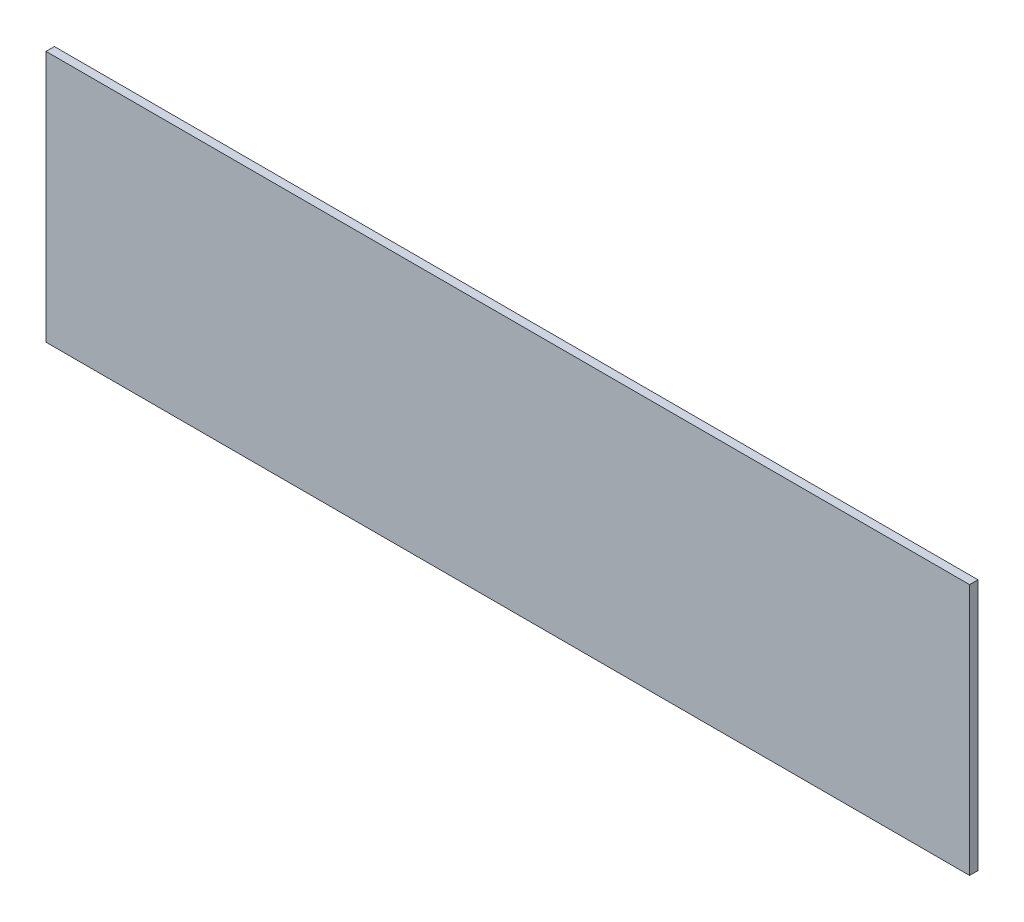
ISO-10303-21;
HEADER;
FILE_DESCRIPTION(('STEP AP214'),'2;1');
FILE_NAME('part.step','',(''),(''),'','','');
FILE_SCHEMA(('AUTOMOTIVE_DESIGN { 1 0 10303 214 1 1 1 1 }'));
ENDSEC;
DATA;
#1=APPLICATION_CONTEXT('core data for automotive mechanical design processes');
#2=APPLICATION_PROTOCOL_DEFINITION('international standard','automotive_design',2000,#1);
#3=PRODUCT_CONTEXT('',#1,'mechanical');
#4=PRODUCT('Part','Part','',(#3));
#5=PRODUCT_RELATED_PRODUCT_CATEGORY('part','',(#4));
#6=PRODUCT_DEFINITION_FORMATION('','',#4);
#7=PRODUCT_DEFINITION_CONTEXT('part definition',#1,'design');
#8=PRODUCT_DEFINITION('design','',#6,#7);
#9=PRODUCT_DEFINITION_SHAPE('','',#8);
#10=(LENGTH_UNIT() NAMED_UNIT(*) SI_UNIT(.MILLI.,.METRE.));
#11=(NAMED_UNIT(*) PLANE_ANGLE_UNIT() SI_UNIT($,.RADIAN.));
#12=(NAMED_UNIT(*) SI_UNIT($,.STERADIAN.) SOLID_ANGLE_UNIT());
#13=UNCERTAINTY_MEASURE_WITH_UNIT(LENGTH_MEASURE(1.E-05),#10,'distance_accuracy_value','');
#14=(GEOMETRIC_REPRESENTATION_CONTEXT(3) GLOBAL_UNCERTAINTY_ASSIGNED_CONTEXT((#13)) GLOBAL_UNIT_ASSIGNED_CONTEXT((#10,
#11,#12)) REPRESENTATION_CONTEXT('',''));
#15=CARTESIAN_POINT('',(0.,0.,0.));
#16=DIRECTION('',(0.,0.,1.));
#17=DIRECTION('',(1.,0.,0.));
#18=AXIS2_PLACEMENT_3D('',#15,#16,#17);
#19=CARTESIAN_POINT('',(275.,75.,5.));
#20=DIRECTION('',(-1.,0.,0.));
#21=DIRECTION('',(0.,0.,1.));
#22=AXIS2_PLACEMENT_3D('',#19,#20,#21);
#23=PLANE('',#22);
#24=DIRECTION('',(0.,1.,0.));
#25=VECTOR('',#24,1.);
#26=CARTESIAN_POINT('',(275.,75.,0.));
#27=LINE('',#26,#25);
#28=CARTESIAN_POINT('',(275.,-75.,0.));
#29=VERTEX_POINT('',#28);
#30=CARTESIAN_POINT('',(275.,75.,0.));
#31=VERTEX_POINT('',#30);
#32=EDGE_CURVE('E96',#29,#31,#27,.T.);
#33=ORIENTED_EDGE('',*,*,#32,.T.);
#34=DIRECTION('',(0.,0.,-1.));
#35=VECTOR('',#34,1.);
#36=CARTESIAN_POINT('',(275.,75.,5.));
#37=LINE('',#36,#35);
#38=CARTESIAN_POINT('',(275.,75.,5.));
#39=VERTEX_POINT('',#38);
#40=EDGE_CURVE('E11',#39,#31,#37,.T.);
#41=ORIENTED_EDGE('',*,*,#40,.F.);
#42=DIRECTION('',(0.,1.,0.));
#43=VECTOR('',#42,1.);
#44=CARTESIAN_POINT('',(275.,75.,5.));
#45=LINE('',#44,#43);
#46=CARTESIAN_POINT('',(275.,-75.,5.));
#47=VERTEX_POINT('',#46);
#48=EDGE_CURVE('E84',#47,#39,#45,.T.);
#49=ORIENTED_EDGE('',*,*,#48,.F.);
#50=DIRECTION('',(0.,0.,-1.));
#51=VECTOR('',#50,1.);
#52=CARTESIAN_POINT('',(275.,-75.,5.));
#53=LINE('',#52,#51);
#54=EDGE_CURVE('E92',#47,#29,#53,.T.);
#55=ORIENTED_EDGE('',*,*,#54,.T.);
#56=EDGE_LOOP('',(#33,#41,#49,#55));
#57=FACE_BOUND('',#56,.T.);
#58=ADVANCED_FACE('F33',(#57),#23,.F.);
#59=CARTESIAN_POINT('',(-275.,75.,5.));
#60=DIRECTION('',(0.,-1.,0.));
#61=DIRECTION('',(0.,0.,-1.));
#62=AXIS2_PLACEMENT_3D('',#59,#60,#61);
#63=PLANE('',#62);
#64=DIRECTION('',(-1.,0.,0.));
#65=VECTOR('',#64,1.);
#66=CARTESIAN_POINT('',(-275.,75.,0.));
#67=LINE('',#66,#65);
#68=CARTESIAN_POINT('',(-275.,75.,0.));
#69=VERTEX_POINT('',#68);
#70=EDGE_CURVE('E88',#31,#69,#67,.T.);
#71=ORIENTED_EDGE('',*,*,#70,.T.);
#72=DIRECTION('',(0.,0.,-1.));
#73=VECTOR('',#72,1.);
#74=CARTESIAN_POINT('',(-275.,75.,5.));
#75=LINE('',#74,#73);
#76=CARTESIAN_POINT('',(-275.,75.,5.));
#77=VERTEX_POINT('',#76);
#78=EDGE_CURVE('E41',#77,#69,#75,.T.);
#79=ORIENTED_EDGE('',*,*,#78,.F.);
#80=DIRECTION('',(-1.,0.,0.));
#81=VECTOR('',#80,1.);
#82=CARTESIAN_POINT('',(-275.,75.,5.));
#83=LINE('',#82,#81);
#84=EDGE_CURVE('E79',#39,#77,#83,.T.);
#85=ORIENTED_EDGE('',*,*,#84,.F.);
#86=ORIENTED_EDGE('',*,*,#40,.T.);
#87=EDGE_LOOP('',(#71,#79,#85,#86));
#88=FACE_BOUND('',#87,.T.);
#89=ADVANCED_FACE('F87',(#88),#63,.F.);
#90=CARTESIAN_POINT('',(-275.,75.,5.));
#91=DIRECTION('',(1.,0.,0.));
#92=DIRECTION('',(0.,1.,0.));
#93=AXIS2_PLACEMENT_3D('',#90,#91,#92);
#94=PLANE('',#93);
#95=DIRECTION('',(0.,-1.,0.));
#96=VECTOR('',#95,1.);
#97=CARTESIAN_POINT('',(-275.,75.,0.));
#98=LINE('',#97,#96);
#99=CARTESIAN_POINT('',(-275.,-75.,0.));
#100=VERTEX_POINT('',#99);
#101=EDGE_CURVE('E66',#69,#100,#98,.T.);
#102=ORIENTED_EDGE('',*,*,#101,.T.);
#103=DIRECTION('',(0.,0.,-1.));
#104=VECTOR('',#103,1.);
#105=CARTESIAN_POINT('',(-275.,-75.,5.));
#106=LINE('',#105,#104);
#107=CARTESIAN_POINT('',(-275.,-75.,5.));
#108=VERTEX_POINT('',#107);
#109=EDGE_CURVE('E89',#108,#100,#106,.T.);
#110=ORIENTED_EDGE('',*,*,#109,.F.);
#111=DIRECTION('',(0.,-1.,0.));
#112=VECTOR('',#111,1.);
#113=CARTESIAN_POINT('',(-275.,75.,5.));
#114=LINE('',#113,#112);
#115=EDGE_CURVE('E82',#77,#108,#114,.T.);
#116=ORIENTED_EDGE('',*,*,#115,.F.);
#117=ORIENTED_EDGE('',*,*,#78,.T.);
#118=EDGE_LOOP('',(#102,#110,#116,#117));
#119=FACE_BOUND('',#118,.T.);
#120=ADVANCED_FACE('F90',(#119),#94,.F.);
#121=CARTESIAN_POINT('',(-275.,-75.,5.));
#122=DIRECTION('',(0.,1.,0.));
#123=DIRECTION('',(0.,0.,1.));
#124=AXIS2_PLACEMENT_3D('',#121,#122,#123);
#125=PLANE('',#124);
#126=DIRECTION('',(1.,0.,0.));
#127=VECTOR('',#126,1.);
#128=CARTESIAN_POINT('',(-275.,-75.,0.));
#129=LINE('',#128,#127);
#130=EDGE_CURVE('E72',#100,#29,#129,.T.);
#131=ORIENTED_EDGE('',*,*,#130,.T.);
#132=ORIENTED_EDGE('',*,*,#54,.F.);
#133=DIRECTION('',(1.,0.,0.));
#134=VECTOR('',#133,1.);
#135=CARTESIAN_POINT('',(-275.,-75.,5.));
#136=LINE('',#135,#134);
#137=EDGE_CURVE('E49',#108,#47,#136,.T.);
#138=ORIENTED_EDGE('',*,*,#137,.F.);
#139=ORIENTED_EDGE('',*,*,#109,.T.);
#140=EDGE_LOOP('',(#131,#132,#138,#139));
#141=FACE_BOUND('',#140,.T.);
#142=ADVANCED_FACE('F103',(#141),#125,.F.);
#143=CARTESIAN_POINT('',(0.,0.,5.));
#144=DIRECTION('',(0.,0.,1.));
#145=DIRECTION('',(1.,0.,0.));
#146=AXIS2_PLACEMENT_3D('',#143,#144,#145);
#147=PLANE('',#146);
#148=ORIENTED_EDGE('',*,*,#48,.T.);
#149=ORIENTED_EDGE('',*,*,#84,.T.);
#150=ORIENTED_EDGE('',*,*,#115,.T.);
#151=ORIENTED_EDGE('',*,*,#137,.T.);
#152=EDGE_LOOP('',(#148,#149,#150,#151));
#153=FACE_BOUND('',#152,.T.);
#154=ADVANCED_FACE('F80',(#153),#147,.T.);
#155=CARTESIAN_POINT('',(0.,0.,0.));
#156=DIRECTION('',(0.,0.,1.));
#157=DIRECTION('',(1.,0.,0.));
#158=AXIS2_PLACEMENT_3D('',#155,#156,#157);
#159=PLANE('',#158);
#160=ORIENTED_EDGE('',*,*,#32,.F.);
#161=ORIENTED_EDGE('',*,*,#130,.F.);
#162=ORIENTED_EDGE('',*,*,#101,.F.);
#163=ORIENTED_EDGE('',*,*,#70,.F.);
#164=EDGE_LOOP('',(#160,#161,#162,#163));
#165=FACE_BOUND('',#164,.T.);
#166=ADVANCED_FACE('F106',(#165),#159,.F.);
#167=CLOSED_SHELL('',(#58,#89,#120,#142,#154,#166));
#168=MANIFOLD_SOLID_BREP('B2',#167);
#169=ADVANCED_BREP_SHAPE_REPRESENTATION('',(#18,#168),#14);
#170=SHAPE_DEFINITION_REPRESENTATION(#9,#169);
ENDSEC;
END-ISO-10303-21;
